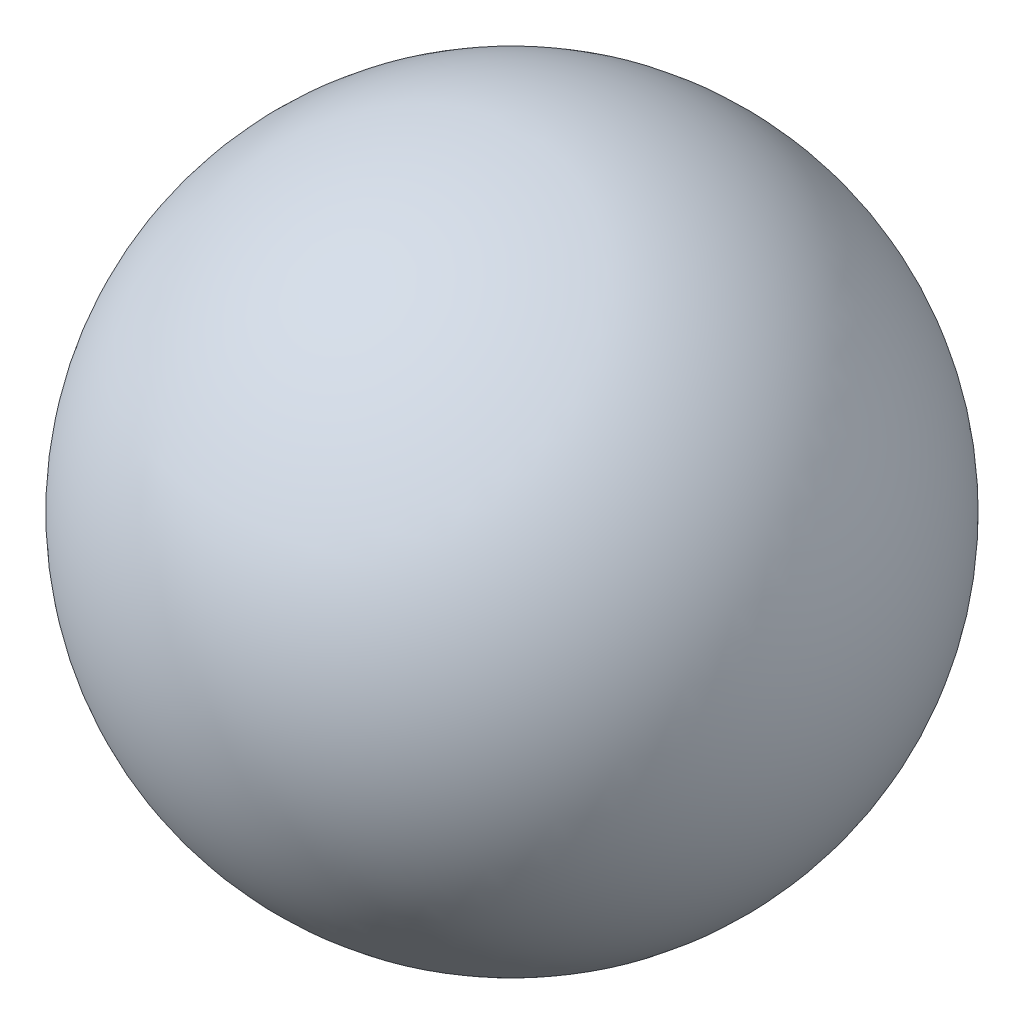
ISO-10303-21;
HEADER;
FILE_DESCRIPTION(('STEP AP214'),'2;1');
FILE_NAME('part.step','',(''),(''),'','','');
FILE_SCHEMA(('AUTOMOTIVE_DESIGN { 1 0 10303 214 1 1 1 1 }'));
ENDSEC;
DATA;
#1=APPLICATION_CONTEXT('core data for automotive mechanical design processes');
#2=APPLICATION_PROTOCOL_DEFINITION('international standard','automotive_design',2000,#1);
#3=PRODUCT_CONTEXT('',#1,'mechanical');
#4=PRODUCT('Part','Part','',(#3));
#5=PRODUCT_RELATED_PRODUCT_CATEGORY('part','',(#4));
#6=PRODUCT_DEFINITION_FORMATION('','',#4);
#7=PRODUCT_DEFINITION_CONTEXT('part definition',#1,'design');
#8=PRODUCT_DEFINITION('design','',#6,#7);
#9=PRODUCT_DEFINITION_SHAPE('','',#8);
#10=(LENGTH_UNIT() NAMED_UNIT(*) SI_UNIT(.MILLI.,.METRE.));
#11=(NAMED_UNIT(*) PLANE_ANGLE_UNIT() SI_UNIT($,.RADIAN.));
#12=(NAMED_UNIT(*) SI_UNIT($,.STERADIAN.) SOLID_ANGLE_UNIT());
#13=UNCERTAINTY_MEASURE_WITH_UNIT(LENGTH_MEASURE(1.E-05),#10,'distance_accuracy_value','');
#14=(GEOMETRIC_REPRESENTATION_CONTEXT(3) GLOBAL_UNCERTAINTY_ASSIGNED_CONTEXT((#13)) GLOBAL_UNIT_ASSIGNED_CONTEXT((#10,
#11,#12)) REPRESENTATION_CONTEXT('',''));
#15=CARTESIAN_POINT('',(0.,0.,0.));
#16=DIRECTION('',(0.,0.,1.));
#17=DIRECTION('',(1.,0.,0.));
#18=AXIS2_PLACEMENT_3D('',#15,#16,#17);
#19=CARTESIAN_POINT('',(0.,0.,0.));
#20=DIRECTION('',(0.,-1.,0.));
#21=DIRECTION('',(-1.,0.,0.));
#22=AXIS2_PLACEMENT_3D('',#19,#20,#21);
#23=SPHERICAL_SURFACE('',#22,203.2);
#24=CARTESIAN_POINT('',(0.,-203.2,0.));
#25=VERTEX_POINT('',#24);
#26=VERTEX_LOOP('',#25);
#27=FACE_BOUND('',#26,.T.);
#28=ADVANCED_FACE('F41',(#27),#23,.T.);
#29=CLOSED_SHELL('',(#28));
#30=MANIFOLD_SOLID_BREP('B2',#29);
#31=ADVANCED_BREP_SHAPE_REPRESENTATION('',(#18,#30),#14);
#32=SHAPE_DEFINITION_REPRESENTATION(#9,#31);
ENDSEC;
END-ISO-10303-21;
